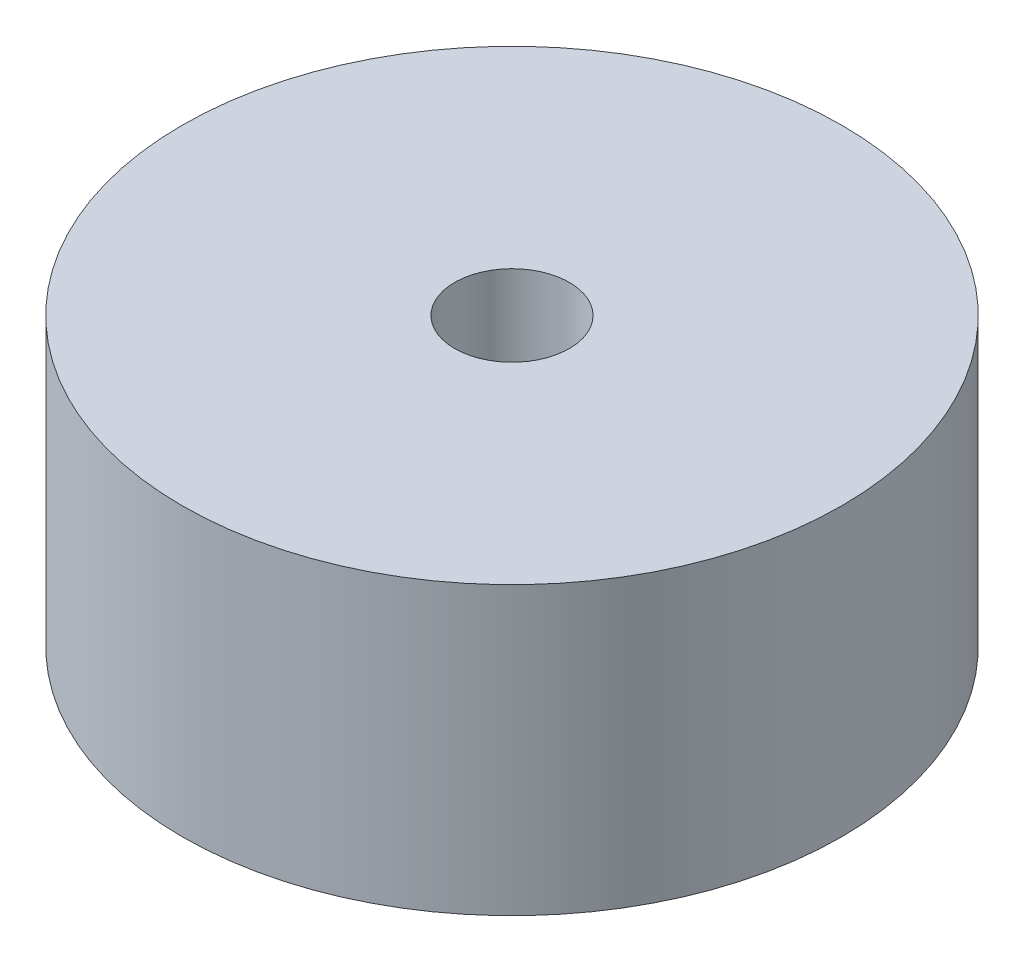
ISO-10303-21;
HEADER;
FILE_DESCRIPTION(('STEP AP214'),'2;1');
FILE_NAME('part.step','',(''),(''),'','','');
FILE_SCHEMA(('AUTOMOTIVE_DESIGN { 1 0 10303 214 1 1 1 1 }'));
ENDSEC;
DATA;
#1=APPLICATION_CONTEXT('core data for automotive mechanical design processes');
#2=APPLICATION_PROTOCOL_DEFINITION('international standard','automotive_design',2000,#1);
#3=PRODUCT_CONTEXT('',#1,'mechanical');
#4=PRODUCT('Part','Part','',(#3));
#5=PRODUCT_RELATED_PRODUCT_CATEGORY('part','',(#4));
#6=PRODUCT_DEFINITION_FORMATION('','',#4);
#7=PRODUCT_DEFINITION_CONTEXT('part definition',#1,'design');
#8=PRODUCT_DEFINITION('design','',#6,#7);
#9=PRODUCT_DEFINITION_SHAPE('','',#8);
#10=(LENGTH_UNIT() NAMED_UNIT(*) SI_UNIT(.MILLI.,.METRE.));
#11=(NAMED_UNIT(*) PLANE_ANGLE_UNIT() SI_UNIT($,.RADIAN.));
#12=(NAMED_UNIT(*) SI_UNIT($,.STERADIAN.) SOLID_ANGLE_UNIT());
#13=UNCERTAINTY_MEASURE_WITH_UNIT(LENGTH_MEASURE(1.E-05),#10,'distance_accuracy_value','');
#14=(GEOMETRIC_REPRESENTATION_CONTEXT(3) GLOBAL_UNCERTAINTY_ASSIGNED_CONTEXT((#13)) GLOBAL_UNIT_ASSIGNED_CONTEXT((#10,
#11,#12)) REPRESENTATION_CONTEXT('',''));
#15=CARTESIAN_POINT('',(0.,0.,0.));
#16=DIRECTION('',(0.,0.,1.));
#17=DIRECTION('',(1.,0.,0.));
#18=AXIS2_PLACEMENT_3D('',#15,#16,#17);
#19=CARTESIAN_POINT('',(0.,20.,0.));
#20=DIRECTION('',(0.,-1.,0.));
#21=DIRECTION('',(0.,0.,-1.));
#22=AXIS2_PLACEMENT_3D('',#19,#20,#21);
#23=CYLINDRICAL_SURFACE('',#22,23.);
#24=CARTESIAN_POINT('',(0.,20.,0.));
#25=DIRECTION('',(0.,1.,0.));
#26=DIRECTION('',(0.,0.,1.));
#27=AXIS2_PLACEMENT_3D('',#24,#25,#26);
#28=CIRCLE('',#27,23.);
#29=CARTESIAN_POINT('',(0.,20.,23.));
#30=VERTEX_POINT('',#29);
#31=EDGE_CURVE('E11',#30,#30,#28,.T.);
#32=ORIENTED_EDGE('',*,*,#31,.F.);
#33=EDGE_LOOP('',(#32));
#34=FACE_BOUND('',#33,.T.);
#35=CARTESIAN_POINT('',(0.,0.,0.));
#36=DIRECTION('',(0.,1.,0.));
#37=DIRECTION('',(0.,0.,1.));
#38=AXIS2_PLACEMENT_3D('',#35,#36,#37);
#39=CIRCLE('',#38,23.);
#40=CARTESIAN_POINT('',(0.,0.,23.));
#41=VERTEX_POINT('',#40);
#42=EDGE_CURVE('E52',#41,#41,#39,.T.);
#43=ORIENTED_EDGE('',*,*,#42,.T.);
#44=EDGE_LOOP('',(#43));
#45=FACE_BOUND('',#44,.T.);
#46=ADVANCED_FACE('F49',(#34,#45),#23,.T.);
#47=CARTESIAN_POINT('',(0.,20.,0.));
#48=DIRECTION('',(0.,1.,0.));
#49=DIRECTION('',(0.,0.,1.));
#50=AXIS2_PLACEMENT_3D('',#47,#48,#49);
#51=PLANE('',#50);
#52=CARTESIAN_POINT('',(0.,20.,0.));
#53=DIRECTION('',(0.,1.,0.));
#54=DIRECTION('',(0.,0.,1.));
#55=AXIS2_PLACEMENT_3D('',#52,#53,#54);
#56=CIRCLE('',#55,4.);
#57=CARTESIAN_POINT('',(0.,20.,4.));
#58=VERTEX_POINT('',#57);
#59=EDGE_CURVE('E155',#58,#58,#56,.T.);
#60=ORIENTED_EDGE('',*,*,#59,.F.);
#61=EDGE_LOOP('',(#60));
#62=FACE_BOUND('',#61,.T.);
#63=ORIENTED_EDGE('',*,*,#31,.T.);
#64=EDGE_LOOP('',(#63));
#65=FACE_BOUND('',#64,.T.);
#66=ADVANCED_FACE('F172',(#62,#65),#51,.T.);
#67=CARTESIAN_POINT('',(0.,0.,0.));
#68=DIRECTION('',(0.,1.,0.));
#69=DIRECTION('',(0.,0.,1.));
#70=AXIS2_PLACEMENT_3D('',#67,#68,#69);
#71=PLANE('',#70);
#72=CARTESIAN_POINT('',(7.5,0.,0.));
#73=DIRECTION('',(0.,-1.,0.));
#74=DIRECTION('',(0.,0.,-1.));
#75=AXIS2_PLACEMENT_3D('',#72,#73,#74);
#76=CIRCLE('',#75,1.24999999999999);
#77=CARTESIAN_POINT('',(7.5,0.,-1.24999999999999));
#78=VERTEX_POINT('',#77);
#79=EDGE_CURVE('E94',#78,#78,#76,.T.);
#80=ORIENTED_EDGE('',*,*,#79,.F.);
#81=EDGE_LOOP('',(#80));
#82=FACE_BOUND('',#81,.T.);
#83=CARTESIAN_POINT('',(-7.5,0.,0.));
#84=DIRECTION('',(0.,-1.,0.));
#85=DIRECTION('',(0.,0.,-1.));
#86=AXIS2_PLACEMENT_3D('',#83,#84,#85);
#87=CIRCLE('',#86,1.24999999999999);
#88=CARTESIAN_POINT('',(-7.5,0.,-1.24999999999999));
#89=VERTEX_POINT('',#88);
#90=EDGE_CURVE('E93',#89,#89,#87,.T.);
#91=ORIENTED_EDGE('',*,*,#90,.F.);
#92=EDGE_LOOP('',(#91));
#93=FACE_BOUND('',#92,.T.);
#94=CARTESIAN_POINT('',(0.,0.,-7.5));
#95=DIRECTION('',(0.,-1.,0.));
#96=DIRECTION('',(0.,0.,-1.));
#97=AXIS2_PLACEMENT_3D('',#94,#95,#96);
#98=CIRCLE('',#97,1.24999999999999);
#99=CARTESIAN_POINT('',(0.,0.,-8.74999999999999));
#100=VERTEX_POINT('',#99);
#101=EDGE_CURVE('E107',#100,#100,#98,.T.);
#102=ORIENTED_EDGE('',*,*,#101,.F.);
#103=EDGE_LOOP('',(#102));
#104=FACE_BOUND('',#103,.T.);
#105=CARTESIAN_POINT('',(0.,0.,7.5));
#106=DIRECTION('',(0.,-1.,0.));
#107=DIRECTION('',(0.,0.,-1.));
#108=AXIS2_PLACEMENT_3D('',#105,#106,#107);
#109=CIRCLE('',#108,1.24999999999999);
#110=CARTESIAN_POINT('',(0.,0.,6.25000000000001));
#111=VERTEX_POINT('',#110);
#112=EDGE_CURVE('E115',#111,#111,#109,.T.);
#113=ORIENTED_EDGE('',*,*,#112,.F.);
#114=EDGE_LOOP('',(#113));
#115=FACE_BOUND('',#114,.T.);
#116=CARTESIAN_POINT('',(6.7175144212722,0.,-6.7175144212722));
#117=DIRECTION('',(0.,-1.,0.));
#118=DIRECTION('',(0.,0.,-1.));
#119=AXIS2_PLACEMENT_3D('',#116,#117,#118);
#120=CIRCLE('',#119,1.24999999999999);
#121=CARTESIAN_POINT('',(6.7175144212722,0.,-7.96751442127219));
#122=VERTEX_POINT('',#121);
#123=EDGE_CURVE('E123',#122,#122,#120,.T.);
#124=ORIENTED_EDGE('',*,*,#123,.F.);
#125=EDGE_LOOP('',(#124));
#126=FACE_BOUND('',#125,.T.);
#127=CARTESIAN_POINT('',(6.7175144212722,0.,6.7175144212722));
#128=DIRECTION('',(0.,-1.,0.));
#129=DIRECTION('',(0.,0.,-1.));
#130=AXIS2_PLACEMENT_3D('',#127,#128,#129);
#131=CIRCLE('',#130,1.24999999999999);
#132=CARTESIAN_POINT('',(6.7175144212722,0.,5.46751442127221));
#133=VERTEX_POINT('',#132);
#134=EDGE_CURVE('E131',#133,#133,#131,.T.);
#135=ORIENTED_EDGE('',*,*,#134,.F.);
#136=EDGE_LOOP('',(#135));
#137=FACE_BOUND('',#136,.T.);
#138=CARTESIAN_POINT('',(-6.7175144212722,0.,6.7175144212722));
#139=DIRECTION('',(0.,-1.,0.));
#140=DIRECTION('',(0.,0.,-1.));
#141=AXIS2_PLACEMENT_3D('',#138,#139,#140);
#142=CIRCLE('',#141,1.24999999999999);
#143=CARTESIAN_POINT('',(-6.7175144212722,0.,5.46751442127221));
#144=VERTEX_POINT('',#143);
#145=EDGE_CURVE('E139',#144,#144,#142,.T.);
#146=ORIENTED_EDGE('',*,*,#145,.F.);
#147=EDGE_LOOP('',(#146));
#148=FACE_BOUND('',#147,.T.);
#149=CARTESIAN_POINT('',(-6.7175144212722,0.,-6.7175144212722));
#150=DIRECTION('',(0.,-1.,0.));
#151=DIRECTION('',(0.,0.,-1.));
#152=AXIS2_PLACEMENT_3D('',#149,#150,#151);
#153=CIRCLE('',#152,1.24999999999999);
#154=CARTESIAN_POINT('',(-6.7175144212722,0.,-7.96751442127219));
#155=VERTEX_POINT('',#154);
#156=EDGE_CURVE('E147',#155,#155,#153,.T.);
#157=ORIENTED_EDGE('',*,*,#156,.F.);
#158=EDGE_LOOP('',(#157));
#159=FACE_BOUND('',#158,.T.);
#160=CARTESIAN_POINT('',(0.,0.,0.));
#161=DIRECTION('',(0.,1.,0.));
#162=DIRECTION('',(0.,0.,1.));
#163=AXIS2_PLACEMENT_3D('',#160,#161,#162);
#164=CIRCLE('',#163,4.);
#165=CARTESIAN_POINT('',(0.,0.,4.));
#166=VERTEX_POINT('',#165);
#167=EDGE_CURVE('E159',#166,#166,#164,.F.);
#168=ORIENTED_EDGE('',*,*,#167,.F.);
#169=EDGE_LOOP('',(#168));
#170=FACE_BOUND('',#169,.T.);
#171=ORIENTED_EDGE('',*,*,#42,.F.);
#172=EDGE_LOOP('',(#171));
#173=FACE_BOUND('',#172,.T.);
#174=ADVANCED_FACE('F169',(#82,#93,#104,#115,#126,#137,#148,#159,#170,#173),#71,.F.);
#175=CARTESIAN_POINT('',(0.,-11.3137084989848,0.));
#176=DIRECTION('',(0.,1.,0.));
#177=DIRECTION('',(0.,0.,1.));
#178=AXIS2_PLACEMENT_3D('',#175,#176,#177);
#179=CYLINDRICAL_SURFACE('',#178,4.);
#180=ORIENTED_EDGE('',*,*,#167,.T.);
#181=EDGE_LOOP('',(#180));
#182=FACE_BOUND('',#181,.T.);
#183=ORIENTED_EDGE('',*,*,#59,.T.);
#184=EDGE_LOOP('',(#183));
#185=FACE_BOUND('',#184,.T.);
#186=ADVANCED_FACE('F171',(#182,#185),#179,.F.);
#187=CARTESIAN_POINT('',(-6.7175144212722,6.50000000000001,-6.7175144212722));
#188=DIRECTION('',(0.,-1.,0.));
#189=DIRECTION('',(0.,0.,-1.));
#190=AXIS2_PLACEMENT_3D('',#187,#188,#189);
#191=CONICAL_SURFACE('',#190,1.24999999999999,1.02974425867665);
#192=CARTESIAN_POINT('',(-6.7175144212722,7.25107577378445,-6.7175144212722));
#193=VERTEX_POINT('',#192);
#194=VERTEX_LOOP('',#193);
#195=FACE_BOUND('',#194,.T.);
#196=CARTESIAN_POINT('',(-6.7175144212722,6.50000000000001,-6.7175144212722));
#197=DIRECTION('',(0.,-1.,0.));
#198=DIRECTION('',(0.,0.,-1.));
#199=AXIS2_PLACEMENT_3D('',#196,#197,#198);
#200=CIRCLE('',#199,1.24999999999999);
#201=CARTESIAN_POINT('',(-6.7175144212722,6.50000000000001,-7.96751442127219));
#202=VERTEX_POINT('',#201);
#203=EDGE_CURVE('E151',#202,#202,#200,.T.);
#204=ORIENTED_EDGE('',*,*,#203,.T.);
#205=EDGE_LOOP('',(#204));
#206=FACE_BOUND('',#205,.T.);
#207=ADVANCED_FACE('F178',(#195,#206),#191,.F.);
#208=CARTESIAN_POINT('',(-6.7175144212722,0.,-6.7175144212722));
#209=DIRECTION('',(0.,-1.,0.));
#210=DIRECTION('',(0.,0.,-1.));
#211=AXIS2_PLACEMENT_3D('',#208,#209,#210);
#212=CYLINDRICAL_SURFACE('',#211,1.24999999999999);
#213=ORIENTED_EDGE('',*,*,#203,.F.);
#214=EDGE_LOOP('',(#213));
#215=FACE_BOUND('',#214,.T.);
#216=ORIENTED_EDGE('',*,*,#156,.T.);
#217=EDGE_LOOP('',(#216));
#218=FACE_BOUND('',#217,.T.);
#219=ADVANCED_FACE('F221',(#215,#218),#212,.F.);
#220=CARTESIAN_POINT('',(-6.7175144212722,6.50000000000001,6.7175144212722));
#221=DIRECTION('',(0.,-1.,0.));
#222=DIRECTION('',(0.,0.,-1.));
#223=AXIS2_PLACEMENT_3D('',#220,#221,#222);
#224=CONICAL_SURFACE('',#223,1.24999999999999,1.02974425867665);
#225=CARTESIAN_POINT('',(-6.7175144212722,7.25107577378445,6.7175144212722));
#226=VERTEX_POINT('',#225);
#227=VERTEX_LOOP('',#226);
#228=FACE_BOUND('',#227,.T.);
#229=CARTESIAN_POINT('',(-6.7175144212722,6.50000000000001,6.7175144212722));
#230=DIRECTION('',(0.,-1.,0.));
#231=DIRECTION('',(0.,0.,-1.));
#232=AXIS2_PLACEMENT_3D('',#229,#230,#231);
#233=CIRCLE('',#232,1.24999999999999);
#234=CARTESIAN_POINT('',(-6.7175144212722,6.50000000000001,5.46751442127221));
#235=VERTEX_POINT('',#234);
#236=EDGE_CURVE('E143',#235,#235,#233,.T.);
#237=ORIENTED_EDGE('',*,*,#236,.T.);
#238=EDGE_LOOP('',(#237));
#239=FACE_BOUND('',#238,.T.);
#240=ADVANCED_FACE('F232',(#228,#239),#224,.F.);
#241=CARTESIAN_POINT('',(-6.7175144212722,0.,6.7175144212722));
#242=DIRECTION('',(0.,-1.,0.));
#243=DIRECTION('',(0.,0.,-1.));
#244=AXIS2_PLACEMENT_3D('',#241,#242,#243);
#245=CYLINDRICAL_SURFACE('',#244,1.24999999999999);
#246=ORIENTED_EDGE('',*,*,#236,.F.);
#247=EDGE_LOOP('',(#246));
#248=FACE_BOUND('',#247,.T.);
#249=ORIENTED_EDGE('',*,*,#145,.T.);
#250=EDGE_LOOP('',(#249));
#251=FACE_BOUND('',#250,.T.);
#252=ADVANCED_FACE('F245',(#248,#251),#245,.F.);
#253=CARTESIAN_POINT('',(6.7175144212722,6.50000000000001,6.7175144212722));
#254=DIRECTION('',(0.,-1.,0.));
#255=DIRECTION('',(0.,0.,-1.));
#256=AXIS2_PLACEMENT_3D('',#253,#254,#255);
#257=CONICAL_SURFACE('',#256,1.24999999999999,1.02974425867665);
#258=CARTESIAN_POINT('',(6.7175144212722,7.25107577378445,6.7175144212722));
#259=VERTEX_POINT('',#258);
#260=VERTEX_LOOP('',#259);
#261=FACE_BOUND('',#260,.T.);
#262=CARTESIAN_POINT('',(6.7175144212722,6.50000000000001,6.7175144212722));
#263=DIRECTION('',(0.,-1.,0.));
#264=DIRECTION('',(0.,0.,-1.));
#265=AXIS2_PLACEMENT_3D('',#262,#263,#264);
#266=CIRCLE('',#265,1.24999999999999);
#267=CARTESIAN_POINT('',(6.7175144212722,6.50000000000001,5.46751442127221));
#268=VERTEX_POINT('',#267);
#269=EDGE_CURVE('E135',#268,#268,#266,.T.);
#270=ORIENTED_EDGE('',*,*,#269,.T.);
#271=EDGE_LOOP('',(#270));
#272=FACE_BOUND('',#271,.T.);
#273=ADVANCED_FACE('F255',(#261,#272),#257,.F.);
#274=CARTESIAN_POINT('',(6.7175144212722,0.,6.7175144212722));
#275=DIRECTION('',(0.,-1.,0.));
#276=DIRECTION('',(0.,0.,-1.));
#277=AXIS2_PLACEMENT_3D('',#274,#275,#276);
#278=CYLINDRICAL_SURFACE('',#277,1.24999999999999);
#279=ORIENTED_EDGE('',*,*,#269,.F.);
#280=EDGE_LOOP('',(#279));
#281=FACE_BOUND('',#280,.T.);
#282=ORIENTED_EDGE('',*,*,#134,.T.);
#283=EDGE_LOOP('',(#282));
#284=FACE_BOUND('',#283,.T.);
#285=ADVANCED_FACE('F268',(#281,#284),#278,.F.);
#286=CARTESIAN_POINT('',(6.7175144212722,6.50000000000001,-6.7175144212722));
#287=DIRECTION('',(0.,-1.,0.));
#288=DIRECTION('',(0.,0.,-1.));
#289=AXIS2_PLACEMENT_3D('',#286,#287,#288);
#290=CONICAL_SURFACE('',#289,1.24999999999999,1.02974425867665);
#291=CARTESIAN_POINT('',(6.7175144212722,7.25107577378445,-6.7175144212722));
#292=VERTEX_POINT('',#291);
#293=VERTEX_LOOP('',#292);
#294=FACE_BOUND('',#293,.T.);
#295=CARTESIAN_POINT('',(6.7175144212722,6.50000000000001,-6.7175144212722));
#296=DIRECTION('',(0.,-1.,0.));
#297=DIRECTION('',(0.,0.,-1.));
#298=AXIS2_PLACEMENT_3D('',#295,#296,#297);
#299=CIRCLE('',#298,1.24999999999999);
#300=CARTESIAN_POINT('',(6.7175144212722,6.50000000000001,-7.96751442127219));
#301=VERTEX_POINT('',#300);
#302=EDGE_CURVE('E127',#301,#301,#299,.T.);
#303=ORIENTED_EDGE('',*,*,#302,.T.);
#304=EDGE_LOOP('',(#303));
#305=FACE_BOUND('',#304,.T.);
#306=ADVANCED_FACE('F279',(#294,#305),#290,.F.);
#307=CARTESIAN_POINT('',(6.7175144212722,0.,-6.7175144212722));
#308=DIRECTION('',(0.,-1.,0.));
#309=DIRECTION('',(0.,0.,-1.));
#310=AXIS2_PLACEMENT_3D('',#307,#308,#309);
#311=CYLINDRICAL_SURFACE('',#310,1.24999999999999);
#312=ORIENTED_EDGE('',*,*,#302,.F.);
#313=EDGE_LOOP('',(#312));
#314=FACE_BOUND('',#313,.T.);
#315=ORIENTED_EDGE('',*,*,#123,.T.);
#316=EDGE_LOOP('',(#315));
#317=FACE_BOUND('',#316,.T.);
#318=ADVANCED_FACE('F292',(#314,#317),#311,.F.);
#319=CARTESIAN_POINT('',(0.,6.50000000000001,7.5));
#320=DIRECTION('',(0.,-1.,0.));
#321=DIRECTION('',(0.,0.,-1.));
#322=AXIS2_PLACEMENT_3D('',#319,#320,#321);
#323=CONICAL_SURFACE('',#322,1.24999999999999,1.02974425867665);
#324=CARTESIAN_POINT('',(0.,7.25107577378445,7.5));
#325=VERTEX_POINT('',#324);
#326=VERTEX_LOOP('',#325);
#327=FACE_BOUND('',#326,.T.);
#328=CARTESIAN_POINT('',(0.,6.50000000000001,7.5));
#329=DIRECTION('',(0.,-1.,0.));
#330=DIRECTION('',(0.,0.,-1.));
#331=AXIS2_PLACEMENT_3D('',#328,#329,#330);
#332=CIRCLE('',#331,1.24999999999999);
#333=CARTESIAN_POINT('',(0.,6.50000000000001,6.25000000000001));
#334=VERTEX_POINT('',#333);
#335=EDGE_CURVE('E119',#334,#334,#332,.T.);
#336=ORIENTED_EDGE('',*,*,#335,.T.);
#337=EDGE_LOOP('',(#336));
#338=FACE_BOUND('',#337,.T.);
#339=ADVANCED_FACE('F303',(#327,#338),#323,.F.);
#340=CARTESIAN_POINT('',(0.,0.,7.5));
#341=DIRECTION('',(0.,-1.,0.));
#342=DIRECTION('',(0.,0.,-1.));
#343=AXIS2_PLACEMENT_3D('',#340,#341,#342);
#344=CYLINDRICAL_SURFACE('',#343,1.24999999999999);
#345=ORIENTED_EDGE('',*,*,#335,.F.);
#346=EDGE_LOOP('',(#345));
#347=FACE_BOUND('',#346,.T.);
#348=ORIENTED_EDGE('',*,*,#112,.T.);
#349=EDGE_LOOP('',(#348));
#350=FACE_BOUND('',#349,.T.);
#351=ADVANCED_FACE('F316',(#347,#350),#344,.F.);
#352=CARTESIAN_POINT('',(0.,6.50000000000001,-7.5));
#353=DIRECTION('',(0.,-1.,0.));
#354=DIRECTION('',(0.,0.,-1.));
#355=AXIS2_PLACEMENT_3D('',#352,#353,#354);
#356=CONICAL_SURFACE('',#355,1.24999999999999,1.02974425867665);
#357=CARTESIAN_POINT('',(0.,7.25107577378445,-7.5));
#358=VERTEX_POINT('',#357);
#359=VERTEX_LOOP('',#358);
#360=FACE_BOUND('',#359,.T.);
#361=CARTESIAN_POINT('',(0.,6.50000000000001,-7.5));
#362=DIRECTION('',(0.,-1.,0.));
#363=DIRECTION('',(0.,0.,-1.));
#364=AXIS2_PLACEMENT_3D('',#361,#362,#363);
#365=CIRCLE('',#364,1.24999999999999);
#366=CARTESIAN_POINT('',(0.,6.50000000000001,-8.74999999999999));
#367=VERTEX_POINT('',#366);
#368=EDGE_CURVE('E111',#367,#367,#365,.T.);
#369=ORIENTED_EDGE('',*,*,#368,.T.);
#370=EDGE_LOOP('',(#369));
#371=FACE_BOUND('',#370,.T.);
#372=ADVANCED_FACE('F327',(#360,#371),#356,.F.);
#373=CARTESIAN_POINT('',(0.,0.,-7.5));
#374=DIRECTION('',(0.,-1.,0.));
#375=DIRECTION('',(0.,0.,-1.));
#376=AXIS2_PLACEMENT_3D('',#373,#374,#375);
#377=CYLINDRICAL_SURFACE('',#376,1.24999999999999);
#378=ORIENTED_EDGE('',*,*,#368,.F.);
#379=EDGE_LOOP('',(#378));
#380=FACE_BOUND('',#379,.T.);
#381=ORIENTED_EDGE('',*,*,#101,.T.);
#382=EDGE_LOOP('',(#381));
#383=FACE_BOUND('',#382,.T.);
#384=ADVANCED_FACE('F340',(#380,#383),#377,.F.);
#385=CARTESIAN_POINT('',(-7.5,6.50000000000001,0.));
#386=DIRECTION('',(0.,-1.,0.));
#387=DIRECTION('',(0.,0.,-1.));
#388=AXIS2_PLACEMENT_3D('',#385,#386,#387);
#389=CONICAL_SURFACE('',#388,1.24999999999999,1.02974425867665);
#390=CARTESIAN_POINT('',(-7.5,7.25107577378445,0.));
#391=VERTEX_POINT('',#390);
#392=VERTEX_LOOP('',#391);
#393=FACE_BOUND('',#392,.T.);
#394=CARTESIAN_POINT('',(-7.5,6.50000000000001,0.));
#395=DIRECTION('',(0.,-1.,0.));
#396=DIRECTION('',(0.,0.,-1.));
#397=AXIS2_PLACEMENT_3D('',#394,#395,#396);
#398=CIRCLE('',#397,1.24999999999999);
#399=CARTESIAN_POINT('',(-7.5,6.50000000000001,-1.24999999999999));
#400=VERTEX_POINT('',#399);
#401=EDGE_CURVE('E99',#400,#400,#398,.T.);
#402=ORIENTED_EDGE('',*,*,#401,.T.);
#403=EDGE_LOOP('',(#402));
#404=FACE_BOUND('',#403,.T.);
#405=ADVANCED_FACE('F351',(#393,#404),#389,.F.);
#406=CARTESIAN_POINT('',(-7.5,0.,0.));
#407=DIRECTION('',(0.,-1.,0.));
#408=DIRECTION('',(0.,0.,-1.));
#409=AXIS2_PLACEMENT_3D('',#406,#407,#408);
#410=CYLINDRICAL_SURFACE('',#409,1.24999999999999);
#411=ORIENTED_EDGE('',*,*,#401,.F.);
#412=EDGE_LOOP('',(#411));
#413=FACE_BOUND('',#412,.T.);
#414=ORIENTED_EDGE('',*,*,#90,.T.);
#415=EDGE_LOOP('',(#414));
#416=FACE_BOUND('',#415,.T.);
#417=ADVANCED_FACE('F86',(#413,#416),#410,.F.);
#418=CARTESIAN_POINT('',(7.5,6.50000000000001,0.));
#419=DIRECTION('',(0.,-1.,0.));
#420=DIRECTION('',(0.,0.,-1.));
#421=AXIS2_PLACEMENT_3D('',#418,#419,#420);
#422=CONICAL_SURFACE('',#421,1.24999999999999,1.02974425867665);
#423=CARTESIAN_POINT('',(7.5,7.25107577378445,0.));
#424=VERTEX_POINT('',#423);
#425=VERTEX_LOOP('',#424);
#426=FACE_BOUND('',#425,.T.);
#427=CARTESIAN_POINT('',(7.5,6.50000000000001,0.));
#428=DIRECTION('',(0.,-1.,0.));
#429=DIRECTION('',(0.,0.,-1.));
#430=AXIS2_PLACEMENT_3D('',#427,#428,#429);
#431=CIRCLE('',#430,1.24999999999999);
#432=CARTESIAN_POINT('',(7.5,6.50000000000001,-1.24999999999999));
#433=VERTEX_POINT('',#432);
#434=EDGE_CURVE('E90',#433,#433,#431,.T.);
#435=ORIENTED_EDGE('',*,*,#434,.T.);
#436=EDGE_LOOP('',(#435));
#437=FACE_BOUND('',#436,.T.);
#438=ADVANCED_FACE('F82',(#426,#437),#422,.F.);
#439=CARTESIAN_POINT('',(7.5,0.,0.));
#440=DIRECTION('',(0.,-1.,0.));
#441=DIRECTION('',(0.,0.,-1.));
#442=AXIS2_PLACEMENT_3D('',#439,#440,#441);
#443=CYLINDRICAL_SURFACE('',#442,1.24999999999999);
#444=ORIENTED_EDGE('',*,*,#434,.F.);
#445=EDGE_LOOP('',(#444));
#446=FACE_BOUND('',#445,.T.);
#447=ORIENTED_EDGE('',*,*,#79,.T.);
#448=EDGE_LOOP('',(#447));
#449=FACE_BOUND('',#448,.T.);
#450=ADVANCED_FACE('F85',(#446,#449),#443,.F.);
#451=CLOSED_SHELL('',(#46,#66,#174,#186,#207,#219,#240,#252,#273,#285,#306,#318,#339,#351,#372,
#384,#405,#417,#438,#450));
#452=MANIFOLD_SOLID_BREP('B2',#451);
#453=ADVANCED_BREP_SHAPE_REPRESENTATION('',(#18,#452),#14);
#454=SHAPE_DEFINITION_REPRESENTATION(#9,#453);
ENDSEC;
END-ISO-10303-21;
